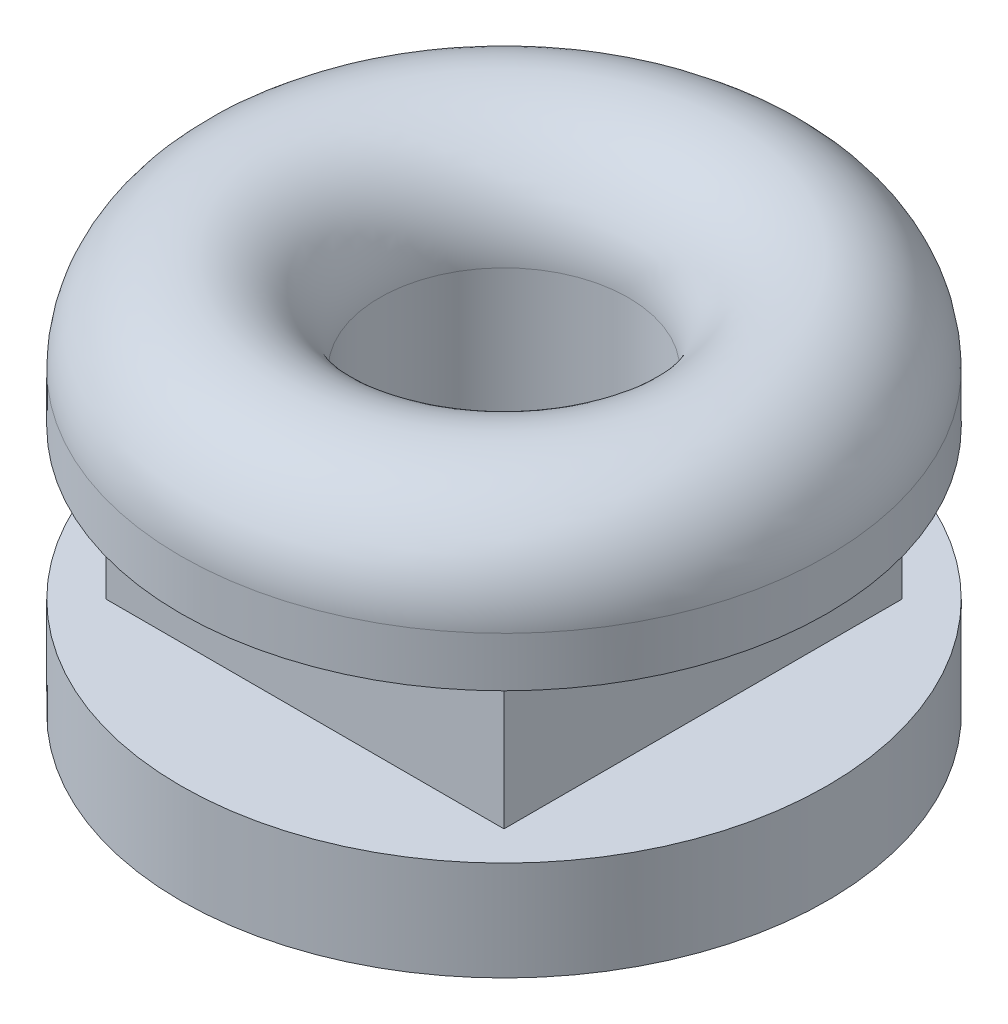
ISO-10303-21;
HEADER;
FILE_DESCRIPTION(('STEP AP214'),'2;1');
FILE_NAME('part.step','',(''),(''),'','','');
FILE_SCHEMA(('AUTOMOTIVE_DESIGN { 1 0 10303 214 1 1 1 1 }'));
ENDSEC;
DATA;
#1=APPLICATION_CONTEXT('core data for automotive mechanical design processes');
#2=APPLICATION_PROTOCOL_DEFINITION('international standard','automotive_design',2000,#1);
#3=PRODUCT_CONTEXT('',#1,'mechanical');
#4=PRODUCT('Part','Part','',(#3));
#5=PRODUCT_RELATED_PRODUCT_CATEGORY('part','',(#4));
#6=PRODUCT_DEFINITION_FORMATION('','',#4);
#7=PRODUCT_DEFINITION_CONTEXT('part definition',#1,'design');
#8=PRODUCT_DEFINITION('design','',#6,#7);
#9=PRODUCT_DEFINITION_SHAPE('','',#8);
#10=(LENGTH_UNIT() NAMED_UNIT(*) SI_UNIT(.MILLI.,.METRE.));
#11=(NAMED_UNIT(*) PLANE_ANGLE_UNIT() SI_UNIT($,.RADIAN.));
#12=(NAMED_UNIT(*) SI_UNIT($,.STERADIAN.) SOLID_ANGLE_UNIT());
#13=UNCERTAINTY_MEASURE_WITH_UNIT(LENGTH_MEASURE(1.E-05),#10,'distance_accuracy_value','');
#14=(GEOMETRIC_REPRESENTATION_CONTEXT(3) GLOBAL_UNCERTAINTY_ASSIGNED_CONTEXT((#13)) GLOBAL_UNIT_ASSIGNED_CONTEXT((#10,
#11,#12)) REPRESENTATION_CONTEXT('',''));
#15=CARTESIAN_POINT('',(0.,0.,0.));
#16=DIRECTION('',(0.,0.,1.));
#17=DIRECTION('',(1.,0.,0.));
#18=AXIS2_PLACEMENT_3D('',#15,#16,#17);
#19=CARTESIAN_POINT('',(0.,0.,0.));
#20=DIRECTION('',(0.,1.,0.));
#21=DIRECTION('',(0.,0.,1.));
#22=AXIS2_PLACEMENT_3D('',#19,#20,#21);
#23=CYLINDRICAL_SURFACE('',#22,6.5);
#24=CARTESIAN_POINT('',(0.,1.,0.));
#25=DIRECTION('',(0.,1.,0.));
#26=DIRECTION('',(0.,0.,1.));
#27=AXIS2_PLACEMENT_3D('',#24,#25,#26);
#28=CIRCLE('',#27,6.5);
#29=CARTESIAN_POINT('',(0.,1.,6.5));
#30=VERTEX_POINT('',#29);
#31=EDGE_CURVE('E115',#30,#30,#28,.T.);
#32=ORIENTED_EDGE('',*,*,#31,.F.);
#33=EDGE_LOOP('',(#32));
#34=FACE_BOUND('',#33,.T.);
#35=CARTESIAN_POINT('',(0.,0.,0.));
#36=DIRECTION('',(0.,-1.,0.));
#37=DIRECTION('',(0.,0.,-1.));
#38=AXIS2_PLACEMENT_3D('',#35,#36,#37);
#39=CIRCLE('',#38,6.5);
#40=CARTESIAN_POINT('',(0.,0.,-6.5));
#41=VERTEX_POINT('',#40);
#42=EDGE_CURVE('E112',#41,#41,#39,.T.);
#43=ORIENTED_EDGE('',*,*,#42,.F.);
#44=EDGE_LOOP('',(#43));
#45=FACE_BOUND('',#44,.T.);
#46=ADVANCED_FACE('F34',(#34,#45),#23,.T.);
#47=CARTESIAN_POINT('',(0.,1.,0.));
#48=DIRECTION('',(0.,1.,0.));
#49=DIRECTION('',(0.,0.,1.));
#50=AXIS2_PLACEMENT_3D('',#47,#48,#49);
#51=TOROIDAL_SURFACE('',#50,4.5,2.);
#52=ORIENTED_EDGE('',*,*,#31,.T.);
#53=EDGE_LOOP('',(#52));
#54=FACE_BOUND('',#53,.T.);
#55=CARTESIAN_POINT('',(0.,1.,0.));
#56=DIRECTION('',(0.,1.,0.));
#57=DIRECTION('',(0.,0.,1.));
#58=AXIS2_PLACEMENT_3D('',#55,#56,#57);
#59=CIRCLE('',#58,2.5);
#60=CARTESIAN_POINT('',(0.,1.,2.5));
#61=VERTEX_POINT('',#60);
#62=EDGE_CURVE('E11',#61,#61,#59,.T.);
#63=ORIENTED_EDGE('',*,*,#62,.F.);
#64=EDGE_LOOP('',(#63));
#65=FACE_BOUND('',#64,.T.);
#66=ADVANCED_FACE('F36',(#54,#65),#51,.T.);
#67=CARTESIAN_POINT('',(0.,0.,0.));
#68=DIRECTION('',(0.,1.,0.));
#69=DIRECTION('',(0.,0.,1.));
#70=AXIS2_PLACEMENT_3D('',#67,#68,#69);
#71=CYLINDRICAL_SURFACE('',#70,2.5);
#72=ORIENTED_EDGE('',*,*,#62,.T.);
#73=EDGE_LOOP('',(#72));
#74=FACE_BOUND('',#73,.T.);
#75=CARTESIAN_POINT('',(0.,-5.,0.));
#76=DIRECTION('',(0.,1.,0.));
#77=DIRECTION('',(0.,0.,1.));
#78=AXIS2_PLACEMENT_3D('',#75,#76,#77);
#79=CIRCLE('',#78,2.5);
#80=CARTESIAN_POINT('',(0.,-5.,2.5));
#81=VERTEX_POINT('',#80);
#82=EDGE_CURVE('E42',#81,#81,#79,.T.);
#83=ORIENTED_EDGE('',*,*,#82,.F.);
#84=EDGE_LOOP('',(#83));
#85=FACE_BOUND('',#84,.T.);
#86=ADVANCED_FACE('F128',(#74,#85),#71,.F.);
#87=CARTESIAN_POINT('',(-2.5,-5.,0.));
#88=DIRECTION('',(0.,-1.,0.));
#89=DIRECTION('',(0.,0.,-1.));
#90=AXIS2_PLACEMENT_3D('',#87,#88,#89);
#91=PLANE('',#90);
#92=ORIENTED_EDGE('',*,*,#82,.T.);
#93=EDGE_LOOP('',(#92));
#94=FACE_BOUND('',#93,.T.);
#95=CARTESIAN_POINT('',(0.,-5.,0.));
#96=DIRECTION('',(0.,1.,0.));
#97=DIRECTION('',(0.,0.,1.));
#98=AXIS2_PLACEMENT_3D('',#95,#96,#97);
#99=CIRCLE('',#98,6.5);
#100=CARTESIAN_POINT('',(0.,-5.,6.5));
#101=VERTEX_POINT('',#100);
#102=EDGE_CURVE('E120',#101,#101,#99,.T.);
#103=ORIENTED_EDGE('',*,*,#102,.F.);
#104=EDGE_LOOP('',(#103));
#105=FACE_BOUND('',#104,.T.);
#106=ADVANCED_FACE('F125',(#94,#105),#91,.T.);
#107=CARTESIAN_POINT('',(0.,-3.,0.));
#108=DIRECTION('',(0.,-1.,0.));
#109=DIRECTION('',(0.,0.,-1.));
#110=AXIS2_PLACEMENT_3D('',#107,#108,#109);
#111=CIRCLE('',#110,6.5);
#112=CARTESIAN_POINT('',(0.,-3.,-6.5));
#113=VERTEX_POINT('',#112);
#114=EDGE_CURVE('E108',#113,#113,#111,.T.);
#115=ORIENTED_EDGE('',*,*,#114,.T.);
#116=EDGE_LOOP('',(#115));
#117=FACE_BOUND('',#116,.T.);
#118=ORIENTED_EDGE('',*,*,#102,.T.);
#119=EDGE_LOOP('',(#118));
#120=FACE_BOUND('',#119,.T.);
#121=ADVANCED_FACE('F135',(#117,#120),#23,.T.);
#122=CARTESIAN_POINT('',(0.,0.,0.));
#123=DIRECTION('',(0.,-1.,0.));
#124=DIRECTION('',(0.,0.,-1.));
#125=AXIS2_PLACEMENT_3D('',#122,#123,#124);
#126=PLANE('',#125);
#127=DIRECTION('',(1.,0.,0.));
#128=VECTOR('',#127,1.);
#129=CARTESIAN_POINT('',(4.,0.,-4.));
#130=LINE('',#129,#128);
#131=CARTESIAN_POINT('',(-4.,0.,-4.));
#132=VERTEX_POINT('',#131);
#133=CARTESIAN_POINT('',(4.,0.,-4.));
#134=VERTEX_POINT('',#133);
#135=EDGE_CURVE('E86',#132,#134,#130,.T.);
#136=ORIENTED_EDGE('',*,*,#135,.F.);
#137=DIRECTION('',(0.,0.,-1.));
#138=VECTOR('',#137,1.);
#139=CARTESIAN_POINT('',(-4.,0.,-4.));
#140=LINE('',#139,#138);
#141=CARTESIAN_POINT('',(-4.,0.,4.));
#142=VERTEX_POINT('',#141);
#143=EDGE_CURVE('E49',#142,#132,#140,.T.);
#144=ORIENTED_EDGE('',*,*,#143,.F.);
#145=DIRECTION('',(-1.,0.,0.));
#146=VECTOR('',#145,1.);
#147=CARTESIAN_POINT('',(4.,0.,4.));
#148=LINE('',#147,#146);
#149=CARTESIAN_POINT('',(4.,0.,4.));
#150=VERTEX_POINT('',#149);
#151=EDGE_CURVE('E81',#150,#142,#148,.T.);
#152=ORIENTED_EDGE('',*,*,#151,.F.);
#153=DIRECTION('',(0.,0.,1.));
#154=VECTOR('',#153,1.);
#155=CARTESIAN_POINT('',(4.,0.,-4.));
#156=LINE('',#155,#154);
#157=EDGE_CURVE('E91',#134,#150,#156,.T.);
#158=ORIENTED_EDGE('',*,*,#157,.F.);
#159=EDGE_LOOP('',(#136,#144,#152,#158));
#160=FACE_BOUND('',#159,.T.);
#161=ORIENTED_EDGE('',*,*,#42,.T.);
#162=EDGE_LOOP('',(#161));
#163=FACE_BOUND('',#162,.T.);
#164=ADVANCED_FACE('F89',(#160,#163),#126,.T.);
#165=CARTESIAN_POINT('',(0.,-3.,0.));
#166=DIRECTION('',(0.,-1.,0.));
#167=DIRECTION('',(0.,0.,-1.));
#168=AXIS2_PLACEMENT_3D('',#165,#166,#167);
#169=PLANE('',#168);
#170=DIRECTION('',(0.,0.,1.));
#171=VECTOR('',#170,1.);
#172=CARTESIAN_POINT('',(4.,-3.,-4.));
#173=LINE('',#172,#171);
#174=CARTESIAN_POINT('',(4.,-3.,-4.));
#175=VERTEX_POINT('',#174);
#176=CARTESIAN_POINT('',(4.,-3.,4.));
#177=VERTEX_POINT('',#176);
#178=EDGE_CURVE('E57',#175,#177,#173,.T.);
#179=ORIENTED_EDGE('',*,*,#178,.T.);
#180=DIRECTION('',(-1.,0.,0.));
#181=VECTOR('',#180,1.);
#182=CARTESIAN_POINT('',(4.,-3.,4.));
#183=LINE('',#182,#181);
#184=CARTESIAN_POINT('',(-4.,-3.,4.));
#185=VERTEX_POINT('',#184);
#186=EDGE_CURVE('E82',#177,#185,#183,.T.);
#187=ORIENTED_EDGE('',*,*,#186,.T.);
#188=DIRECTION('',(0.,0.,-1.));
#189=VECTOR('',#188,1.);
#190=CARTESIAN_POINT('',(-4.,-3.,-4.));
#191=LINE('',#190,#189);
#192=CARTESIAN_POINT('',(-4.,-3.,-4.));
#193=VERTEX_POINT('',#192);
#194=EDGE_CURVE('E98',#185,#193,#191,.T.);
#195=ORIENTED_EDGE('',*,*,#194,.T.);
#196=DIRECTION('',(1.,0.,0.));
#197=VECTOR('',#196,1.);
#198=CARTESIAN_POINT('',(4.,-3.,-4.));
#199=LINE('',#198,#197);
#200=EDGE_CURVE('E96',#193,#175,#199,.T.);
#201=ORIENTED_EDGE('',*,*,#200,.T.);
#202=EDGE_LOOP('',(#179,#187,#195,#201));
#203=FACE_BOUND('',#202,.T.);
#204=ORIENTED_EDGE('',*,*,#114,.F.);
#205=EDGE_LOOP('',(#204));
#206=FACE_BOUND('',#205,.T.);
#207=ADVANCED_FACE('F151',(#203,#206),#169,.F.);
#208=CARTESIAN_POINT('',(4.,0.,-4.));
#209=DIRECTION('',(1.,0.,0.));
#210=DIRECTION('',(0.,0.,-1.));
#211=AXIS2_PLACEMENT_3D('',#208,#209,#210);
#212=PLANE('',#211);
#213=ORIENTED_EDGE('',*,*,#178,.F.);
#214=DIRECTION('',(0.,-1.,0.));
#215=VECTOR('',#214,1.);
#216=CARTESIAN_POINT('',(4.,0.,-4.));
#217=LINE('',#216,#215);
#218=EDGE_CURVE('E95',#134,#175,#217,.T.);
#219=ORIENTED_EDGE('',*,*,#218,.F.);
#220=ORIENTED_EDGE('',*,*,#157,.T.);
#221=DIRECTION('',(0.,-1.,0.));
#222=VECTOR('',#221,1.);
#223=CARTESIAN_POINT('',(4.,0.,4.));
#224=LINE('',#223,#222);
#225=EDGE_CURVE('E79',#150,#177,#224,.T.);
#226=ORIENTED_EDGE('',*,*,#225,.T.);
#227=EDGE_LOOP('',(#213,#219,#220,#226));
#228=FACE_BOUND('',#227,.T.);
#229=ADVANCED_FACE('F94',(#228),#212,.T.);
#230=CARTESIAN_POINT('',(4.,0.,-4.));
#231=DIRECTION('',(0.,0.,-1.));
#232=DIRECTION('',(-1.,0.,0.));
#233=AXIS2_PLACEMENT_3D('',#230,#231,#232);
#234=PLANE('',#233);
#235=ORIENTED_EDGE('',*,*,#200,.F.);
#236=DIRECTION('',(0.,-1.,0.));
#237=VECTOR('',#236,1.);
#238=CARTESIAN_POINT('',(-4.,0.,-4.));
#239=LINE('',#238,#237);
#240=EDGE_CURVE('E109',#132,#193,#239,.T.);
#241=ORIENTED_EDGE('',*,*,#240,.F.);
#242=ORIENTED_EDGE('',*,*,#135,.T.);
#243=ORIENTED_EDGE('',*,*,#218,.T.);
#244=EDGE_LOOP('',(#235,#241,#242,#243));
#245=FACE_BOUND('',#244,.T.);
#246=ADVANCED_FACE('F161',(#245),#234,.T.);
#247=CARTESIAN_POINT('',(-4.,0.,-4.));
#248=DIRECTION('',(-1.,0.,0.));
#249=DIRECTION('',(0.,0.,1.));
#250=AXIS2_PLACEMENT_3D('',#247,#248,#249);
#251=PLANE('',#250);
#252=ORIENTED_EDGE('',*,*,#194,.F.);
#253=DIRECTION('',(0.,-1.,0.));
#254=VECTOR('',#253,1.);
#255=CARTESIAN_POINT('',(-4.,0.,4.));
#256=LINE('',#255,#254);
#257=EDGE_CURVE('E85',#142,#185,#256,.T.);
#258=ORIENTED_EDGE('',*,*,#257,.F.);
#259=ORIENTED_EDGE('',*,*,#143,.T.);
#260=ORIENTED_EDGE('',*,*,#240,.T.);
#261=EDGE_LOOP('',(#252,#258,#259,#260));
#262=FACE_BOUND('',#261,.T.);
#263=ADVANCED_FACE('F166',(#262),#251,.T.);
#264=CARTESIAN_POINT('',(4.,0.,4.));
#265=DIRECTION('',(0.,0.,1.));
#266=DIRECTION('',(1.,0.,0.));
#267=AXIS2_PLACEMENT_3D('',#264,#265,#266);
#268=PLANE('',#267);
#269=ORIENTED_EDGE('',*,*,#186,.F.);
#270=ORIENTED_EDGE('',*,*,#225,.F.);
#271=ORIENTED_EDGE('',*,*,#151,.T.);
#272=ORIENTED_EDGE('',*,*,#257,.T.);
#273=EDGE_LOOP('',(#269,#270,#271,#272));
#274=FACE_BOUND('',#273,.T.);
#275=ADVANCED_FACE('F80',(#274),#268,.T.);
#276=CLOSED_SHELL('',(#46,#66,#86,#106,#121,#164,#207,#229,#246,#263,#275));
#277=MANIFOLD_SOLID_BREP('B2',#276);
#278=ADVANCED_BREP_SHAPE_REPRESENTATION('',(#18,#277),#14);
#279=SHAPE_DEFINITION_REPRESENTATION(#9,#278);
ENDSEC;
END-ISO-10303-21;
